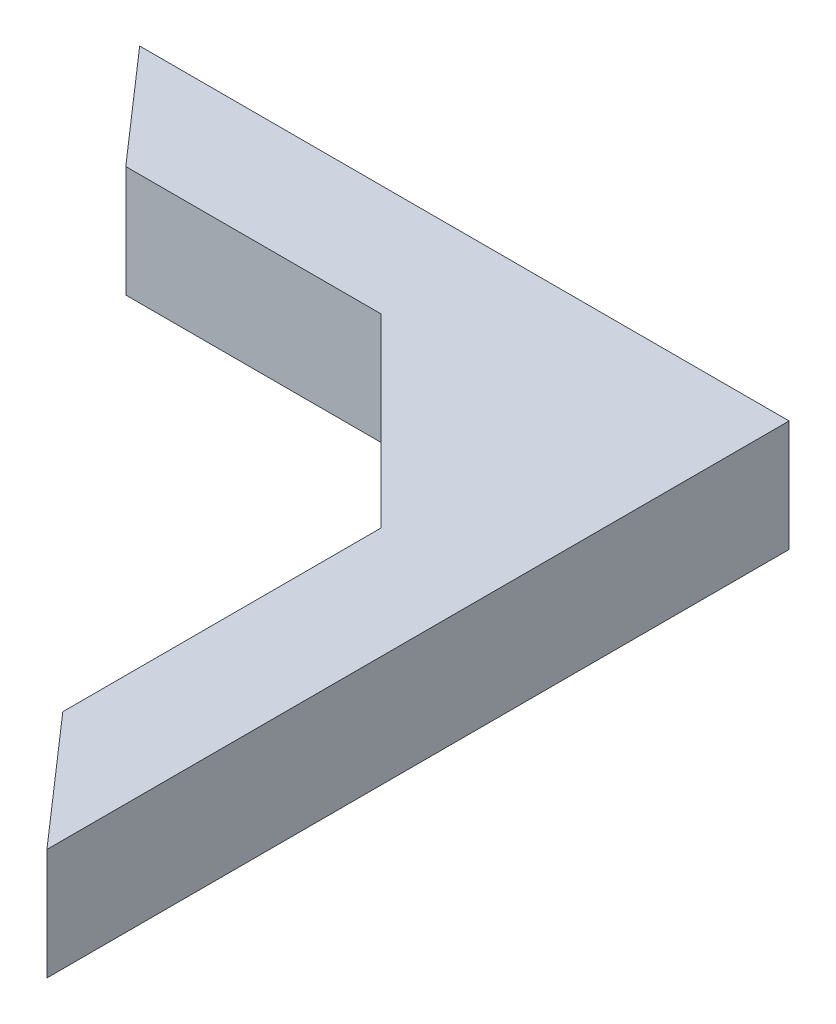
ISO-10303-21;
HEADER;
FILE_DESCRIPTION(('STEP AP214'),'2;1');
FILE_NAME('part.step','',(''),(''),'','','');
FILE_SCHEMA(('AUTOMOTIVE_DESIGN { 1 0 10303 214 1 1 1 1 }'));
ENDSEC;
DATA;
#1=APPLICATION_CONTEXT('core data for automotive mechanical design processes');
#2=APPLICATION_PROTOCOL_DEFINITION('international standard','automotive_design',2000,#1);
#3=PRODUCT_CONTEXT('',#1,'mechanical');
#4=PRODUCT('Part','Part','',(#3));
#5=PRODUCT_RELATED_PRODUCT_CATEGORY('part','',(#4));
#6=PRODUCT_DEFINITION_FORMATION('','',#4);
#7=PRODUCT_DEFINITION_CONTEXT('part definition',#1,'design');
#8=PRODUCT_DEFINITION('design','',#6,#7);
#9=PRODUCT_DEFINITION_SHAPE('','',#8);
#10=(LENGTH_UNIT() NAMED_UNIT(*) SI_UNIT(.MILLI.,.METRE.));
#11=(NAMED_UNIT(*) PLANE_ANGLE_UNIT() SI_UNIT($,.RADIAN.));
#12=(NAMED_UNIT(*) SI_UNIT($,.STERADIAN.) SOLID_ANGLE_UNIT());
#13=UNCERTAINTY_MEASURE_WITH_UNIT(LENGTH_MEASURE(1.E-05),#10,'distance_accuracy_value','');
#14=(GEOMETRIC_REPRESENTATION_CONTEXT(3) GLOBAL_UNCERTAINTY_ASSIGNED_CONTEXT((#13)) GLOBAL_UNIT_ASSIGNED_CONTEXT((#10,
#11,#12)) REPRESENTATION_CONTEXT('',''));
#15=CARTESIAN_POINT('',(0.,0.,0.));
#16=DIRECTION('',(0.,0.,1.));
#17=DIRECTION('',(1.,0.,0.));
#18=AXIS2_PLACEMENT_3D('',#15,#16,#17);
#19=CARTESIAN_POINT('',(-29.75,-3.,6.));
#20=DIRECTION('',(0.752576694706878,0.,-0.658504607868518));
#21=DIRECTION('',(-0.658504607868518,0.,-0.752576694706878));
#22=AXIS2_PLACEMENT_3D('',#19,#20,#21);
#23=PLANE('',#22);
#24=DIRECTION('',(0.658504607868518,0.,0.752576694706878));
#25=VECTOR('',#24,1.);
#26=CARTESIAN_POINT('',(-29.75,3.,6.));
#27=LINE('',#26,#25);
#28=CARTESIAN_POINT('',(-35.,3.,0.));
#29=VERTEX_POINT('',#28);
#30=CARTESIAN_POINT('',(-29.75,3.,6.));
#31=VERTEX_POINT('',#30);
#32=EDGE_CURVE('E154',#29,#31,#27,.T.);
#33=ORIENTED_EDGE('',*,*,#32,.F.);
#34=DIRECTION('',(0.,1.,0.));
#35=VECTOR('',#34,1.);
#36=CARTESIAN_POINT('',(-35.,-3.,0.));
#37=LINE('',#36,#35);
#38=CARTESIAN_POINT('',(-35.,-3.,0.));
#39=VERTEX_POINT('',#38);
#40=EDGE_CURVE('E153',#39,#29,#37,.T.);
#41=ORIENTED_EDGE('',*,*,#40,.F.);
#42=DIRECTION('',(0.658504607868518,0.,0.752576694706878));
#43=VECTOR('',#42,1.);
#44=CARTESIAN_POINT('',(-29.75,-3.,6.));
#45=LINE('',#44,#43);
#46=CARTESIAN_POINT('',(-29.75,-3.,6.));
#47=VERTEX_POINT('',#46);
#48=EDGE_CURVE('E177',#39,#47,#45,.T.);
#49=ORIENTED_EDGE('',*,*,#48,.T.);
#50=DIRECTION('',(0.,1.,0.));
#51=VECTOR('',#50,1.);
#52=CARTESIAN_POINT('',(-29.75,-3.,6.));
#53=LINE('',#52,#51);
#54=EDGE_CURVE('E12',#47,#31,#53,.T.);
#55=ORIENTED_EDGE('',*,*,#54,.T.);
#56=EDGE_LOOP('',(#33,#41,#49,#55));
#57=FACE_BOUND('',#56,.T.);
#58=ADVANCED_FACE('F45',(#57),#23,.F.);
#59=CARTESIAN_POINT('',(-29.75,-3.,6.));
#60=DIRECTION('',(0.,0.,-1.));
#61=DIRECTION('',(-1.,0.,0.));
#62=AXIS2_PLACEMENT_3D('',#59,#60,#61);
#63=PLANE('',#62);
#64=DIRECTION('',(1.,0.,0.));
#65=VECTOR('',#64,1.);
#66=CARTESIAN_POINT('',(-29.75,3.,6.));
#67=LINE('',#66,#65);
#68=CARTESIAN_POINT('',(-16.,3.,6.));
#69=VERTEX_POINT('',#68);
#70=EDGE_CURVE('E157',#31,#69,#67,.T.);
#71=ORIENTED_EDGE('',*,*,#70,.F.);
#72=ORIENTED_EDGE('',*,*,#54,.F.);
#73=DIRECTION('',(1.,0.,0.));
#74=VECTOR('',#73,1.);
#75=CARTESIAN_POINT('',(-29.75,-3.,6.));
#76=LINE('',#75,#74);
#77=CARTESIAN_POINT('',(-16.,-3.,6.));
#78=VERTEX_POINT('',#77);
#79=EDGE_CURVE('E106',#47,#78,#76,.T.);
#80=ORIENTED_EDGE('',*,*,#79,.T.);
#81=DIRECTION('',(0.,1.,0.));
#82=VECTOR('',#81,1.);
#83=CARTESIAN_POINT('',(-16.,-3.,6.));
#84=LINE('',#83,#82);
#85=EDGE_CURVE('E53',#78,#69,#84,.T.);
#86=ORIENTED_EDGE('',*,*,#85,.T.);
#87=EDGE_LOOP('',(#71,#72,#80,#86));
#88=FACE_BOUND('',#87,.T.);
#89=ADVANCED_FACE('F191',(#88),#63,.F.);
#90=CARTESIAN_POINT('',(-16.,-3.,6.));
#91=DIRECTION('',(0.707106781186549,0.,-0.707106781186546));
#92=DIRECTION('',(-0.707106781186546,0.,-0.707106781186549));
#93=AXIS2_PLACEMENT_3D('',#90,#91,#92);
#94=PLANE('',#93);
#95=DIRECTION('',(0.707106781186546,0.,0.707106781186549));
#96=VECTOR('',#95,1.);
#97=CARTESIAN_POINT('',(-16.,3.,6.));
#98=LINE('',#97,#96);
#99=CARTESIAN_POINT('',(-6.,3.,16.));
#100=VERTEX_POINT('',#99);
#101=EDGE_CURVE('E162',#69,#100,#98,.T.);
#102=ORIENTED_EDGE('',*,*,#101,.F.);
#103=ORIENTED_EDGE('',*,*,#85,.F.);
#104=DIRECTION('',(0.707106781186546,0.,0.707106781186549));
#105=VECTOR('',#104,1.);
#106=CARTESIAN_POINT('',(-16.,-3.,6.));
#107=LINE('',#106,#105);
#108=CARTESIAN_POINT('',(-6.,-3.,16.));
#109=VERTEX_POINT('',#108);
#110=EDGE_CURVE('E147',#78,#109,#107,.T.);
#111=ORIENTED_EDGE('',*,*,#110,.T.);
#112=DIRECTION('',(0.,1.,0.));
#113=VECTOR('',#112,1.);
#114=CARTESIAN_POINT('',(-6.,-3.,16.));
#115=LINE('',#114,#113);
#116=EDGE_CURVE('E184',#109,#100,#115,.T.);
#117=ORIENTED_EDGE('',*,*,#116,.T.);
#118=EDGE_LOOP('',(#102,#103,#111,#117));
#119=FACE_BOUND('',#118,.T.);
#120=ADVANCED_FACE('F206',(#119),#94,.F.);
#121=CARTESIAN_POINT('',(-6.,-3.,16.));
#122=DIRECTION('',(1.,0.,0.));
#123=DIRECTION('',(0.,0.,-1.));
#124=AXIS2_PLACEMENT_3D('',#121,#122,#123);
#125=PLANE('',#124);
#126=DIRECTION('',(0.,0.,1.));
#127=VECTOR('',#126,1.);
#128=CARTESIAN_POINT('',(-6.,3.,16.));
#129=LINE('',#128,#127);
#130=CARTESIAN_POINT('',(-6.,3.,33.1428571428571));
#131=VERTEX_POINT('',#130);
#132=EDGE_CURVE('E166',#100,#131,#129,.T.);
#133=ORIENTED_EDGE('',*,*,#132,.F.);
#134=ORIENTED_EDGE('',*,*,#116,.F.);
#135=DIRECTION('',(0.,0.,1.));
#136=VECTOR('',#135,1.);
#137=CARTESIAN_POINT('',(-6.,-3.,16.));
#138=LINE('',#137,#136);
#139=CARTESIAN_POINT('',(-6.,-3.,33.1428571428571));
#140=VERTEX_POINT('',#139);
#141=EDGE_CURVE('E144',#109,#140,#138,.T.);
#142=ORIENTED_EDGE('',*,*,#141,.T.);
#143=DIRECTION('',(0.,1.,0.));
#144=VECTOR('',#143,1.);
#145=CARTESIAN_POINT('',(-6.,-3.,33.1428571428571));
#146=LINE('',#145,#144);
#147=EDGE_CURVE('E137',#140,#131,#146,.T.);
#148=ORIENTED_EDGE('',*,*,#147,.T.);
#149=EDGE_LOOP('',(#133,#134,#142,#148));
#150=FACE_BOUND('',#149,.T.);
#151=ADVANCED_FACE('F209',(#150),#125,.F.);
#152=CARTESIAN_POINT('',(0.,-3.,40.));
#153=DIRECTION('',(0.752576694706877,0.,-0.658504607868518));
#154=DIRECTION('',(-0.658504607868518,0.,-0.752576694706878));
#155=AXIS2_PLACEMENT_3D('',#152,#153,#154);
#156=PLANE('',#155);
#157=DIRECTION('',(0.658504607868518,0.,0.752576694706878));
#158=VECTOR('',#157,1.);
#159=CARTESIAN_POINT('',(0.,3.,40.));
#160=LINE('',#159,#158);
#161=CARTESIAN_POINT('',(0.,3.,40.));
#162=VERTEX_POINT('',#161);
#163=EDGE_CURVE('E170',#131,#162,#160,.T.);
#164=ORIENTED_EDGE('',*,*,#163,.F.);
#165=ORIENTED_EDGE('',*,*,#147,.F.);
#166=DIRECTION('',(0.658504607868518,0.,0.752576694706878));
#167=VECTOR('',#166,1.);
#168=CARTESIAN_POINT('',(0.,-3.,40.));
#169=LINE('',#168,#167);
#170=CARTESIAN_POINT('',(0.,-3.,40.));
#171=VERTEX_POINT('',#170);
#172=EDGE_CURVE('E124',#140,#171,#169,.T.);
#173=ORIENTED_EDGE('',*,*,#172,.T.);
#174=DIRECTION('',(0.,1.,0.));
#175=VECTOR('',#174,1.);
#176=CARTESIAN_POINT('',(0.,-3.,40.));
#177=LINE('',#176,#175);
#178=EDGE_CURVE('E131',#171,#162,#177,.T.);
#179=ORIENTED_EDGE('',*,*,#178,.T.);
#180=EDGE_LOOP('',(#164,#165,#173,#179));
#181=FACE_BOUND('',#180,.T.);
#182=ADVANCED_FACE('F140',(#181),#156,.F.);
#183=CARTESIAN_POINT('',(0.,-3.,0.));
#184=DIRECTION('',(-1.,0.,0.));
#185=DIRECTION('',(0.,0.,1.));
#186=AXIS2_PLACEMENT_3D('',#183,#184,#185);
#187=PLANE('',#186);
#188=DIRECTION('',(0.,0.,-1.));
#189=VECTOR('',#188,1.);
#190=CARTESIAN_POINT('',(0.,3.,0.));
#191=LINE('',#190,#189);
#192=CARTESIAN_POINT('',(0.,3.,0.));
#193=VERTEX_POINT('',#192);
#194=EDGE_CURVE('E133',#162,#193,#191,.T.);
#195=ORIENTED_EDGE('',*,*,#194,.F.);
#196=ORIENTED_EDGE('',*,*,#178,.F.);
#197=DIRECTION('',(0.,0.,-1.));
#198=VECTOR('',#197,1.);
#199=CARTESIAN_POINT('',(0.,-3.,0.));
#200=LINE('',#199,#198);
#201=CARTESIAN_POINT('',(0.,-3.,0.));
#202=VERTEX_POINT('',#201);
#203=EDGE_CURVE('E120',#171,#202,#200,.T.);
#204=ORIENTED_EDGE('',*,*,#203,.T.);
#205=DIRECTION('',(0.,1.,0.));
#206=VECTOR('',#205,1.);
#207=CARTESIAN_POINT('',(0.,-3.,0.));
#208=LINE('',#207,#206);
#209=EDGE_CURVE('E138',#202,#193,#208,.T.);
#210=ORIENTED_EDGE('',*,*,#209,.T.);
#211=EDGE_LOOP('',(#195,#196,#204,#210));
#212=FACE_BOUND('',#211,.T.);
#213=ADVANCED_FACE('F132',(#212),#187,.F.);
#214=CARTESIAN_POINT('',(-35.,-3.,0.));
#215=DIRECTION('',(0.,0.,1.));
#216=DIRECTION('',(1.,0.,0.));
#217=AXIS2_PLACEMENT_3D('',#214,#215,#216);
#218=PLANE('',#217);
#219=DIRECTION('',(-1.,0.,0.));
#220=VECTOR('',#219,1.);
#221=CARTESIAN_POINT('',(-35.,3.,0.));
#222=LINE('',#221,#220);
#223=EDGE_CURVE('E99',#193,#29,#222,.T.);
#224=ORIENTED_EDGE('',*,*,#223,.F.);
#225=ORIENTED_EDGE('',*,*,#209,.F.);
#226=DIRECTION('',(-1.,0.,0.));
#227=VECTOR('',#226,1.);
#228=CARTESIAN_POINT('',(-35.,-3.,0.));
#229=LINE('',#228,#227);
#230=EDGE_CURVE('E69',#202,#39,#229,.T.);
#231=ORIENTED_EDGE('',*,*,#230,.T.);
#232=ORIENTED_EDGE('',*,*,#40,.T.);
#233=EDGE_LOOP('',(#224,#225,#231,#232));
#234=FACE_BOUND('',#233,.T.);
#235=ADVANCED_FACE('F248',(#234),#218,.F.);
#236=CARTESIAN_POINT('',(0.,-3.,0.));
#237=DIRECTION('',(0.,1.,0.));
#238=DIRECTION('',(0.,0.,-1.));
#239=AXIS2_PLACEMENT_3D('',#236,#237,#238);
#240=PLANE('',#239);
#241=DIRECTION('',(1.,0.,0.));
#242=VECTOR('',#241,1.);
#243=CARTESIAN_POINT('',(-28.8424635468163,-3.,4.));
#244=LINE('',#243,#242);
#245=CARTESIAN_POINT('',(-28.8424635468163,-3.,4.));
#246=VERTEX_POINT('',#245);
#247=CARTESIAN_POINT('',(-15.1715728752538,-3.,4.));
#248=VERTEX_POINT('',#247);
#249=EDGE_CURVE('E480',#246,#248,#244,.T.);
#250=ORIENTED_EDGE('',*,*,#249,.T.);
#251=DIRECTION('',(0.707106781186547,0.,0.707106781186547));
#252=VECTOR('',#251,1.);
#253=CARTESIAN_POINT('',(-15.1715728752538,-3.,4.));
#254=LINE('',#253,#252);
#255=CARTESIAN_POINT('',(-4.,-3.,15.1715728752538));
#256=VERTEX_POINT('',#255);
#257=EDGE_CURVE('E476',#248,#256,#254,.T.);
#258=ORIENTED_EDGE('',*,*,#257,.T.);
#259=DIRECTION('',(0.,0.,1.));
#260=VECTOR('',#259,1.);
#261=CARTESIAN_POINT('',(-4.,-3.,15.1715728752538));
#262=LINE('',#261,#260);
#263=CARTESIAN_POINT('',(-4.,-3.,32.3913869106472));
#264=VERTEX_POINT('',#263);
#265=EDGE_CURVE('E470',#256,#264,#262,.T.);
#266=ORIENTED_EDGE('',*,*,#265,.T.);
#267=DIRECTION('',(0.658504607868518,0.,0.752576694706877));
#268=VECTOR('',#267,1.);
#269=CARTESIAN_POINT('',(-4.,-3.,32.3913869106472));
#270=LINE('',#269,#268);
#271=CARTESIAN_POINT('',(-2.,-3.,34.6771011963615));
#272=VERTEX_POINT('',#271);
#273=EDGE_CURVE('E466',#264,#272,#270,.T.);
#274=ORIENTED_EDGE('',*,*,#273,.T.);
#275=DIRECTION('',(0.,0.,-1.));
#276=VECTOR('',#275,1.);
#277=CARTESIAN_POINT('',(-2.,-3.,34.6771011963615));
#278=LINE('',#277,#276);
#279=CARTESIAN_POINT('',(-2.,-3.,2.));
#280=VERTEX_POINT('',#279);
#281=EDGE_CURVE('E462',#272,#280,#278,.T.);
#282=ORIENTED_EDGE('',*,*,#281,.T.);
#283=DIRECTION('',(-1.,0.,0.));
#284=VECTOR('',#283,1.);
#285=CARTESIAN_POINT('',(-2.,-3.,2.));
#286=LINE('',#285,#284);
#287=CARTESIAN_POINT('',(-30.5924635468163,-3.,2.));
#288=VERTEX_POINT('',#287);
#289=EDGE_CURVE('E401',#280,#288,#286,.T.);
#290=ORIENTED_EDGE('',*,*,#289,.T.);
#291=DIRECTION('',(0.658504607868518,0.,0.752576694706878));
#292=VECTOR('',#291,1.);
#293=CARTESIAN_POINT('',(-30.5924635468163,-3.,2.));
#294=LINE('',#293,#292);
#295=EDGE_CURVE('E484',#288,#246,#294,.T.);
#296=ORIENTED_EDGE('',*,*,#295,.T.);
#297=EDGE_LOOP('',(#250,#258,#266,#274,#282,#290,#296));
#298=FACE_BOUND('',#297,.T.);
#299=ORIENTED_EDGE('',*,*,#48,.F.);
#300=ORIENTED_EDGE('',*,*,#230,.F.);
#301=ORIENTED_EDGE('',*,*,#203,.F.);
#302=ORIENTED_EDGE('',*,*,#172,.F.);
#303=ORIENTED_EDGE('',*,*,#141,.F.);
#304=ORIENTED_EDGE('',*,*,#110,.F.);
#305=ORIENTED_EDGE('',*,*,#79,.F.);
#306=EDGE_LOOP('',(#299,#300,#301,#302,#303,#304,#305));
#307=FACE_BOUND('',#306,.T.);
#308=ADVANCED_FACE('F122',(#298,#307),#240,.F.);
#309=CARTESIAN_POINT('',(0.,3.,0.));
#310=DIRECTION('',(0.,1.,0.));
#311=DIRECTION('',(0.,0.,-1.));
#312=AXIS2_PLACEMENT_3D('',#309,#310,#311);
#313=PLANE('',#312);
#314=ORIENTED_EDGE('',*,*,#32,.T.);
#315=ORIENTED_EDGE('',*,*,#70,.T.);
#316=ORIENTED_EDGE('',*,*,#101,.T.);
#317=ORIENTED_EDGE('',*,*,#132,.T.);
#318=ORIENTED_EDGE('',*,*,#163,.T.);
#319=ORIENTED_EDGE('',*,*,#194,.T.);
#320=ORIENTED_EDGE('',*,*,#223,.T.);
#321=EDGE_LOOP('',(#314,#315,#316,#317,#318,#319,#320));
#322=FACE_BOUND('',#321,.T.);
#323=ADVANCED_FACE('F194',(#322),#313,.T.);
#324=CARTESIAN_POINT('',(0.,1.5,0.));
#325=DIRECTION('',(0.,1.,0.));
#326=DIRECTION('',(0.,0.,-1.));
#327=AXIS2_PLACEMENT_3D('',#324,#325,#326);
#328=PLANE('',#327);
#329=DIRECTION('',(-1.,0.,0.));
#330=VECTOR('',#329,1.);
#331=CARTESIAN_POINT('',(-2.,1.5,2.));
#332=LINE('',#331,#330);
#333=CARTESIAN_POINT('',(-2.,1.5,2.));
#334=VERTEX_POINT('',#333);
#335=CARTESIAN_POINT('',(-30.5924635468163,1.5,2.));
#336=VERTEX_POINT('',#335);
#337=EDGE_CURVE('E399',#334,#336,#332,.T.);
#338=ORIENTED_EDGE('',*,*,#337,.F.);
#339=DIRECTION('',(0.,0.,-1.));
#340=VECTOR('',#339,1.);
#341=CARTESIAN_POINT('',(-2.,1.5,34.6771011963615));
#342=LINE('',#341,#340);
#343=CARTESIAN_POINT('',(-2.,1.5,34.6771011963615));
#344=VERTEX_POINT('',#343);
#345=EDGE_CURVE('E406',#344,#334,#342,.T.);
#346=ORIENTED_EDGE('',*,*,#345,.F.);
#347=DIRECTION('',(0.658504607868518,0.,0.752576694706878));
#348=VECTOR('',#347,1.);
#349=CARTESIAN_POINT('',(-4.,1.5,32.3913869106472));
#350=LINE('',#349,#348);
#351=CARTESIAN_POINT('',(-4.,1.5,32.3913869106472));
#352=VERTEX_POINT('',#351);
#353=EDGE_CURVE('E426',#352,#344,#350,.T.);
#354=ORIENTED_EDGE('',*,*,#353,.F.);
#355=DIRECTION('',(0.,0.,1.));
#356=VECTOR('',#355,1.);
#357=CARTESIAN_POINT('',(-4.,1.5,15.1715728752538));
#358=LINE('',#357,#356);
#359=CARTESIAN_POINT('',(-4.,1.5,15.1715728752538));
#360=VERTEX_POINT('',#359);
#361=EDGE_CURVE('E430',#360,#352,#358,.T.);
#362=ORIENTED_EDGE('',*,*,#361,.F.);
#363=DIRECTION('',(0.707106781186548,0.,0.707106781186548));
#364=VECTOR('',#363,1.);
#365=CARTESIAN_POINT('',(-15.1715728752538,1.5,4.));
#366=LINE('',#365,#364);
#367=CARTESIAN_POINT('',(-15.1715728752538,1.5,4.));
#368=VERTEX_POINT('',#367);
#369=EDGE_CURVE('E435',#368,#360,#366,.T.);
#370=ORIENTED_EDGE('',*,*,#369,.F.);
#371=DIRECTION('',(1.,0.,0.));
#372=VECTOR('',#371,1.);
#373=CARTESIAN_POINT('',(-28.8424635468163,1.5,4.));
#374=LINE('',#373,#372);
#375=CARTESIAN_POINT('',(-28.8424635468163,1.50000000000001,4.));
#376=VERTEX_POINT('',#375);
#377=EDGE_CURVE('E440',#376,#368,#374,.T.);
#378=ORIENTED_EDGE('',*,*,#377,.F.);
#379=DIRECTION('',(0.658504607868518,0.,0.752576694706878));
#380=VECTOR('',#379,1.);
#381=CARTESIAN_POINT('',(-30.5924635468163,1.5,2.));
#382=LINE('',#381,#380);
#383=EDGE_CURVE('E419',#336,#376,#382,.T.);
#384=ORIENTED_EDGE('',*,*,#383,.F.);
#385=EDGE_LOOP('',(#338,#346,#354,#362,#370,#378,#384));
#386=FACE_BOUND('',#385,.T.);
#387=ADVANCED_FACE('F273',(#386),#328,.F.);
#388=CARTESIAN_POINT('',(-30.5924635468163,46.4202938068511,2.));
#389=DIRECTION('',(-0.752576694706878,0.,0.658504607868517));
#390=DIRECTION('',(0.658504607868518,0.,0.752576694706878));
#391=AXIS2_PLACEMENT_3D('',#388,#389,#390);
#392=PLANE('',#391);
#393=DIRECTION('',(0.,-1.,0.));
#394=VECTOR('',#393,1.);
#395=CARTESIAN_POINT('',(-30.5924635468163,46.4202938068511,2.));
#396=LINE('',#395,#394);
#397=EDGE_CURVE('E158',#336,#288,#396,.T.);
#398=ORIENTED_EDGE('',*,*,#397,.F.);
#399=ORIENTED_EDGE('',*,*,#383,.T.);
#400=DIRECTION('',(0.,-1.,0.));
#401=VECTOR('',#400,1.);
#402=CARTESIAN_POINT('',(-28.8424635468163,46.4202938068511,4.));
#403=LINE('',#402,#401);
#404=EDGE_CURVE('E443',#376,#246,#403,.T.);
#405=ORIENTED_EDGE('',*,*,#404,.T.);
#406=ORIENTED_EDGE('',*,*,#295,.F.);
#407=EDGE_LOOP('',(#398,#399,#405,#406));
#408=FACE_BOUND('',#407,.T.);
#409=ADVANCED_FACE('F282',(#408),#392,.F.);
#410=CARTESIAN_POINT('',(-28.8424635468163,46.4202938068511,4.));
#411=DIRECTION('',(0.,0.,1.));
#412=DIRECTION('',(1.,0.,0.));
#413=AXIS2_PLACEMENT_3D('',#410,#411,#412);
#414=PLANE('',#413);
#415=ORIENTED_EDGE('',*,*,#404,.F.);
#416=ORIENTED_EDGE('',*,*,#377,.T.);
#417=DIRECTION('',(0.,-1.,0.));
#418=VECTOR('',#417,1.);
#419=CARTESIAN_POINT('',(-15.1715728752538,46.4202938068511,4.));
#420=LINE('',#419,#418);
#421=EDGE_CURVE('E439',#368,#248,#420,.T.);
#422=ORIENTED_EDGE('',*,*,#421,.T.);
#423=ORIENTED_EDGE('',*,*,#249,.F.);
#424=EDGE_LOOP('',(#415,#416,#422,#423));
#425=FACE_BOUND('',#424,.T.);
#426=ADVANCED_FACE('F292',(#425),#414,.F.);
#427=CARTESIAN_POINT('',(-15.1715728752538,46.4202938068511,4.));
#428=DIRECTION('',(-0.707106781186547,0.,0.707106781186547));
#429=DIRECTION('',(0.707106781186548,0.,0.707106781186548));
#430=AXIS2_PLACEMENT_3D('',#427,#428,#429);
#431=PLANE('',#430);
#432=ORIENTED_EDGE('',*,*,#421,.F.);
#433=ORIENTED_EDGE('',*,*,#369,.T.);
#434=DIRECTION('',(0.,-1.,0.));
#435=VECTOR('',#434,1.);
#436=CARTESIAN_POINT('',(-4.,46.4202938068511,15.1715728752538));
#437=LINE('',#436,#435);
#438=EDGE_CURVE('E434',#360,#256,#437,.T.);
#439=ORIENTED_EDGE('',*,*,#438,.T.);
#440=ORIENTED_EDGE('',*,*,#257,.F.);
#441=EDGE_LOOP('',(#432,#433,#439,#440));
#442=FACE_BOUND('',#441,.T.);
#443=ADVANCED_FACE('F302',(#442),#431,.F.);
#444=CARTESIAN_POINT('',(-4.,46.4202938068511,15.1715728752538));
#445=DIRECTION('',(-1.,0.,0.));
#446=DIRECTION('',(0.,0.,1.));
#447=AXIS2_PLACEMENT_3D('',#444,#445,#446);
#448=PLANE('',#447);
#449=ORIENTED_EDGE('',*,*,#438,.F.);
#450=ORIENTED_EDGE('',*,*,#361,.T.);
#451=DIRECTION('',(0.,-1.,0.));
#452=VECTOR('',#451,1.);
#453=CARTESIAN_POINT('',(-4.,46.4202938068511,32.3913869106472));
#454=LINE('',#453,#452);
#455=EDGE_CURVE('E429',#352,#264,#454,.T.);
#456=ORIENTED_EDGE('',*,*,#455,.T.);
#457=ORIENTED_EDGE('',*,*,#265,.F.);
#458=EDGE_LOOP('',(#449,#450,#456,#457));
#459=FACE_BOUND('',#458,.T.);
#460=ADVANCED_FACE('F312',(#459),#448,.F.);
#461=CARTESIAN_POINT('',(-4.,46.4202938068511,32.3913869106472));
#462=DIRECTION('',(-0.752576694706877,0.,0.658504607868518));
#463=DIRECTION('',(0.658504607868518,0.,0.752576694706878));
#464=AXIS2_PLACEMENT_3D('',#461,#462,#463);
#465=PLANE('',#464);
#466=ORIENTED_EDGE('',*,*,#455,.F.);
#467=ORIENTED_EDGE('',*,*,#353,.T.);
#468=DIRECTION('',(0.,-1.,0.));
#469=VECTOR('',#468,1.);
#470=CARTESIAN_POINT('',(-2.,46.4202938068511,34.6771011963615));
#471=LINE('',#470,#469);
#472=EDGE_CURVE('E411',#344,#272,#471,.T.);
#473=ORIENTED_EDGE('',*,*,#472,.T.);
#474=ORIENTED_EDGE('',*,*,#273,.F.);
#475=EDGE_LOOP('',(#466,#467,#473,#474));
#476=FACE_BOUND('',#475,.T.);
#477=ADVANCED_FACE('F322',(#476),#465,.F.);
#478=CARTESIAN_POINT('',(-2.,46.4202938068511,34.6771011963615));
#479=DIRECTION('',(1.,0.,0.));
#480=DIRECTION('',(0.,0.,-1.));
#481=AXIS2_PLACEMENT_3D('',#478,#479,#480);
#482=PLANE('',#481);
#483=ORIENTED_EDGE('',*,*,#472,.F.);
#484=ORIENTED_EDGE('',*,*,#345,.T.);
#485=DIRECTION('',(0.,-1.,0.));
#486=VECTOR('',#485,1.);
#487=CARTESIAN_POINT('',(-2.,46.4202938068511,2.));
#488=LINE('',#487,#486);
#489=EDGE_CURVE('E60',#334,#280,#488,.T.);
#490=ORIENTED_EDGE('',*,*,#489,.T.);
#491=ORIENTED_EDGE('',*,*,#281,.F.);
#492=EDGE_LOOP('',(#483,#484,#490,#491));
#493=FACE_BOUND('',#492,.T.);
#494=ADVANCED_FACE('F332',(#493),#482,.F.);
#495=CARTESIAN_POINT('',(-2.,46.4202938068511,2.));
#496=DIRECTION('',(0.,0.,-1.));
#497=DIRECTION('',(-1.,0.,0.));
#498=AXIS2_PLACEMENT_3D('',#495,#496,#497);
#499=PLANE('',#498);
#500=ORIENTED_EDGE('',*,*,#489,.F.);
#501=ORIENTED_EDGE('',*,*,#337,.T.);
#502=ORIENTED_EDGE('',*,*,#397,.T.);
#503=ORIENTED_EDGE('',*,*,#289,.F.);
#504=EDGE_LOOP('',(#500,#501,#502,#503));
#505=FACE_BOUND('',#504,.T.);
#506=ADVANCED_FACE('F344',(#505),#499,.F.);
#507=CLOSED_SHELL('',(#58,#89,#120,#151,#182,#213,#235,#308,#323,#387,#409,#426,#443,#460,#477,
#494,#506));
#508=MANIFOLD_SOLID_BREP('B2',#507);
#509=ADVANCED_BREP_SHAPE_REPRESENTATION('',(#18,#508),#14);
#510=SHAPE_DEFINITION_REPRESENTATION(#9,#509);
ENDSEC;
END-ISO-10303-21;
